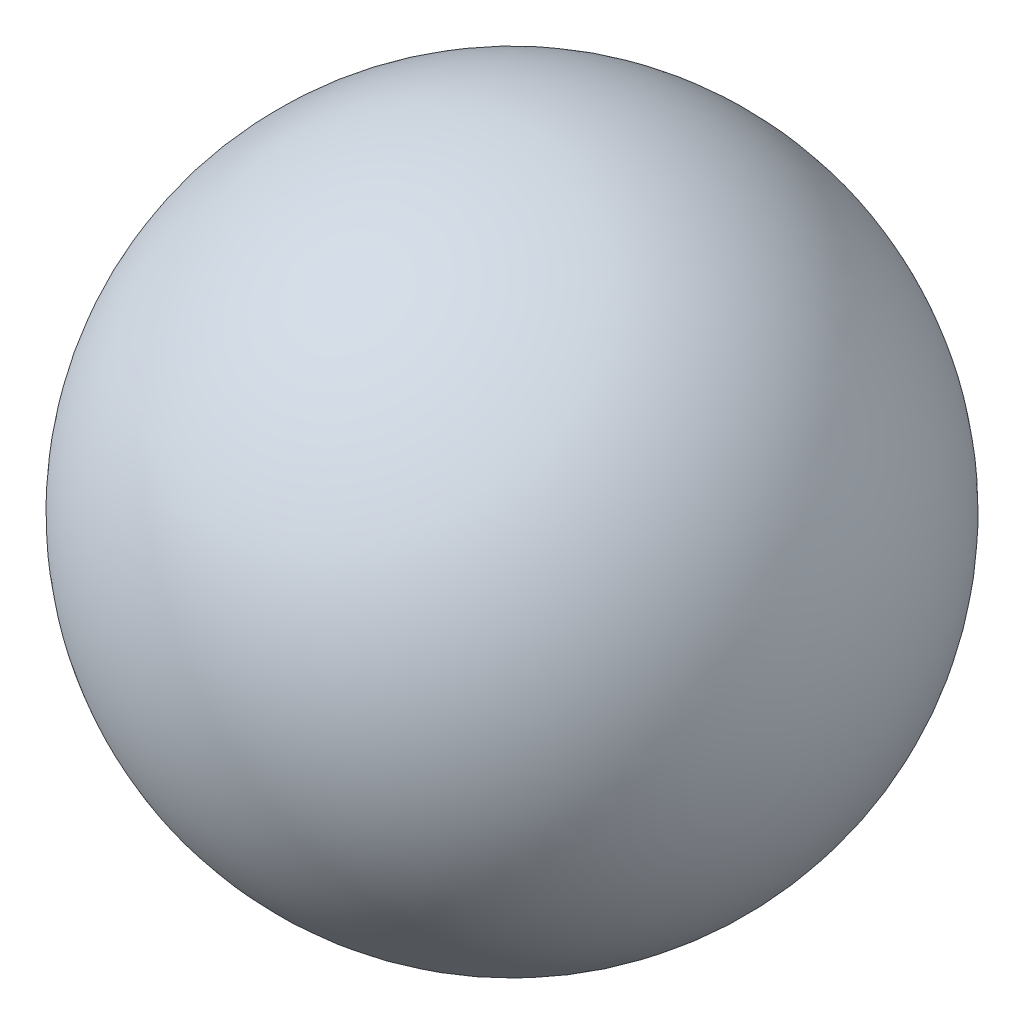
ISO-10303-21;
HEADER;
FILE_DESCRIPTION(('STEP AP214'),'2;1');
FILE_NAME('part.step','',(''),(''),'','','');
FILE_SCHEMA(('AUTOMOTIVE_DESIGN { 1 0 10303 214 1 1 1 1 }'));
ENDSEC;
DATA;
#1=APPLICATION_CONTEXT('core data for automotive mechanical design processes');
#2=APPLICATION_PROTOCOL_DEFINITION('international standard','automotive_design',2000,#1);
#3=PRODUCT_CONTEXT('',#1,'mechanical');
#4=PRODUCT('Part','Part','',(#3));
#5=PRODUCT_RELATED_PRODUCT_CATEGORY('part','',(#4));
#6=PRODUCT_DEFINITION_FORMATION('','',#4);
#7=PRODUCT_DEFINITION_CONTEXT('part definition',#1,'design');
#8=PRODUCT_DEFINITION('design','',#6,#7);
#9=PRODUCT_DEFINITION_SHAPE('','',#8);
#10=(LENGTH_UNIT() NAMED_UNIT(*) SI_UNIT(.MILLI.,.METRE.));
#11=(NAMED_UNIT(*) PLANE_ANGLE_UNIT() SI_UNIT($,.RADIAN.));
#12=(NAMED_UNIT(*) SI_UNIT($,.STERADIAN.) SOLID_ANGLE_UNIT());
#13=UNCERTAINTY_MEASURE_WITH_UNIT(LENGTH_MEASURE(1.E-05),#10,'distance_accuracy_value','');
#14=(GEOMETRIC_REPRESENTATION_CONTEXT(3) GLOBAL_UNCERTAINTY_ASSIGNED_CONTEXT((#13)) GLOBAL_UNIT_ASSIGNED_CONTEXT((#10,
#11,#12)) REPRESENTATION_CONTEXT('',''));
#15=CARTESIAN_POINT('',(0.,0.,0.));
#16=DIRECTION('',(0.,0.,1.));
#17=DIRECTION('',(1.,0.,0.));
#18=AXIS2_PLACEMENT_3D('',#15,#16,#17);
#19=CARTESIAN_POINT('',(8.1084283849148,-2.,8.5038749477346));
#20=DIRECTION('',(0.,0.,1.));
#21=DIRECTION('',(1.,0.,0.));
#22=AXIS2_PLACEMENT_3D('',#19,#20,#21);
#23=SPHERICAL_SURFACE('',#22,1.05);
#24=CARTESIAN_POINT('',(8.1084283849148,-2.,9.5538749477346));
#25=VERTEX_POINT('',#24);
#26=VERTEX_LOOP('',#25);
#27=FACE_BOUND('',#26,.T.);
#28=ADVANCED_FACE('F13',(#27),#23,.T.);
#29=CLOSED_SHELL('',(#28));
#30=MANIFOLD_SOLID_BREP('B1',#29);
#31=ADVANCED_BREP_SHAPE_REPRESENTATION('',(#18,#30),#14);
#32=SHAPE_DEFINITION_REPRESENTATION(#9,#31);
ENDSEC;
END-ISO-10303-21;
